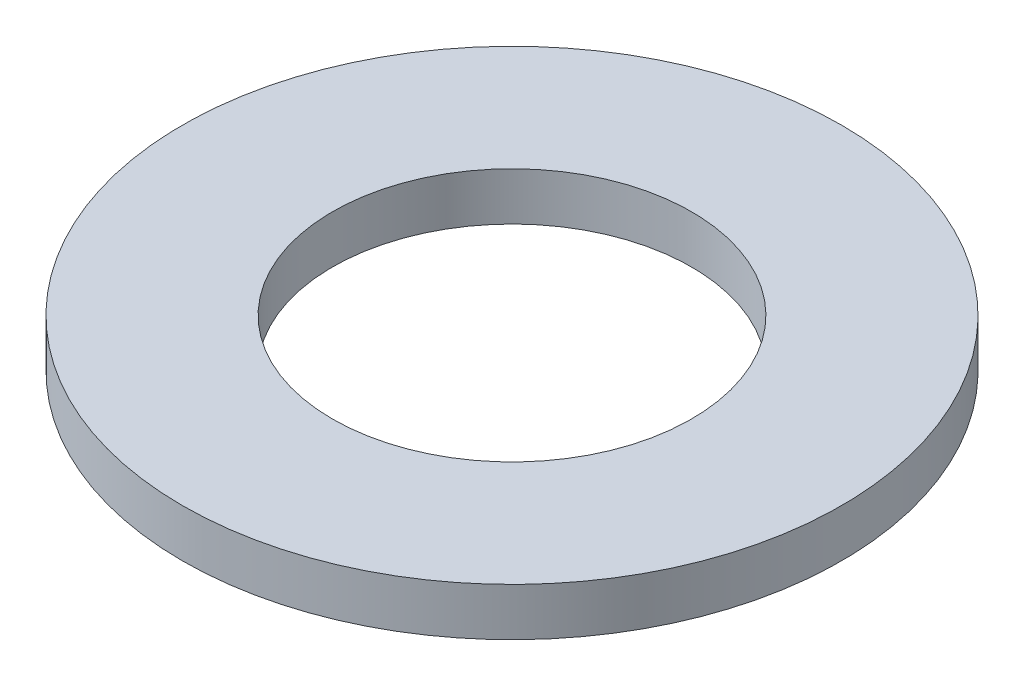
ISO-10303-21;
HEADER;
FILE_DESCRIPTION(('STEP AP214'),'2;1');
FILE_NAME('part.step','',(''),(''),'','','');
FILE_SCHEMA(('AUTOMOTIVE_DESIGN { 1 0 10303 214 1 1 1 1 }'));
ENDSEC;
DATA;
#1=APPLICATION_CONTEXT('core data for automotive mechanical design processes');
#2=APPLICATION_PROTOCOL_DEFINITION('international standard','automotive_design',2000,#1);
#3=PRODUCT_CONTEXT('',#1,'mechanical');
#4=PRODUCT('Part','Part','',(#3));
#5=PRODUCT_RELATED_PRODUCT_CATEGORY('part','',(#4));
#6=PRODUCT_DEFINITION_FORMATION('','',#4);
#7=PRODUCT_DEFINITION_CONTEXT('part definition',#1,'design');
#8=PRODUCT_DEFINITION('design','',#6,#7);
#9=PRODUCT_DEFINITION_SHAPE('','',#8);
#10=(LENGTH_UNIT() NAMED_UNIT(*) SI_UNIT(.MILLI.,.METRE.));
#11=(NAMED_UNIT(*) PLANE_ANGLE_UNIT() SI_UNIT($,.RADIAN.));
#12=(NAMED_UNIT(*) SI_UNIT($,.STERADIAN.) SOLID_ANGLE_UNIT());
#13=UNCERTAINTY_MEASURE_WITH_UNIT(LENGTH_MEASURE(1.E-05),#10,'distance_accuracy_value','');
#14=(GEOMETRIC_REPRESENTATION_CONTEXT(3) GLOBAL_UNCERTAINTY_ASSIGNED_CONTEXT((#13)) GLOBAL_UNIT_ASSIGNED_CONTEXT((#10,
#11,#12)) REPRESENTATION_CONTEXT('',''));
#15=CARTESIAN_POINT('',(0.,0.,0.));
#16=DIRECTION('',(0.,0.,1.));
#17=DIRECTION('',(1.,0.,0.));
#18=AXIS2_PLACEMENT_3D('',#15,#16,#17);
#19=CARTESIAN_POINT('',(0.,0.8636,0.));
#20=DIRECTION('',(0.,-1.,0.));
#21=DIRECTION('',(0.,0.,-1.));
#22=AXIS2_PLACEMENT_3D('',#19,#20,#21);
#23=CYLINDRICAL_SURFACE('',#22,5.9436);
#24=CARTESIAN_POINT('',(0.,0.8636,0.));
#25=DIRECTION('',(0.,1.,0.));
#26=DIRECTION('',(0.,0.,1.));
#27=AXIS2_PLACEMENT_3D('',#24,#25,#26);
#28=CIRCLE('',#27,5.9436);
#29=CARTESIAN_POINT('',(0.,0.8636,5.9436));
#30=VERTEX_POINT('',#29);
#31=EDGE_CURVE('E10',#30,#30,#28,.T.);
#32=ORIENTED_EDGE('',*,*,#31,.F.);
#33=EDGE_LOOP('',(#32));
#34=FACE_BOUND('',#33,.T.);
#35=CARTESIAN_POINT('',(0.,0.,0.));
#36=DIRECTION('',(0.,1.,0.));
#37=DIRECTION('',(0.,0.,1.));
#38=AXIS2_PLACEMENT_3D('',#35,#36,#37);
#39=CIRCLE('',#38,5.9436);
#40=CARTESIAN_POINT('',(0.,0.,5.9436));
#41=VERTEX_POINT('',#40);
#42=EDGE_CURVE('E38',#41,#41,#39,.T.);
#43=ORIENTED_EDGE('',*,*,#42,.T.);
#44=EDGE_LOOP('',(#43));
#45=FACE_BOUND('',#44,.T.);
#46=ADVANCED_FACE('F35',(#34,#45),#23,.T.);
#47=CARTESIAN_POINT('',(0.,0.8636,0.));
#48=DIRECTION('',(0.,1.,0.));
#49=DIRECTION('',(0.,0.,1.));
#50=AXIS2_PLACEMENT_3D('',#47,#48,#49);
#51=PLANE('',#50);
#52=CARTESIAN_POINT('',(0.,0.8636,0.));
#53=DIRECTION('',(0.,1.,0.));
#54=DIRECTION('',(0.,0.,1.));
#55=AXIS2_PLACEMENT_3D('',#52,#53,#54);
#56=CIRCLE('',#55,3.2385);
#57=CARTESIAN_POINT('',(0.,0.8636,3.2385));
#58=VERTEX_POINT('',#57);
#59=EDGE_CURVE('E47',#58,#58,#56,.T.);
#60=ORIENTED_EDGE('',*,*,#59,.F.);
#61=EDGE_LOOP('',(#60));
#62=FACE_BOUND('',#61,.T.);
#63=ORIENTED_EDGE('',*,*,#31,.T.);
#64=EDGE_LOOP('',(#63));
#65=FACE_BOUND('',#64,.T.);
#66=ADVANCED_FACE('F62',(#62,#65),#51,.T.);
#67=CARTESIAN_POINT('',(0.,0.,0.));
#68=DIRECTION('',(0.,1.,0.));
#69=DIRECTION('',(0.,0.,1.));
#70=AXIS2_PLACEMENT_3D('',#67,#68,#69);
#71=PLANE('',#70);
#72=CARTESIAN_POINT('',(0.,0.,0.));
#73=DIRECTION('',(0.,1.,0.));
#74=DIRECTION('',(0.,0.,1.));
#75=AXIS2_PLACEMENT_3D('',#72,#73,#74);
#76=CIRCLE('',#75,3.2385);
#77=CARTESIAN_POINT('',(0.,0.,3.2385));
#78=VERTEX_POINT('',#77);
#79=EDGE_CURVE('E45',#78,#78,#76,.T.);
#80=ORIENTED_EDGE('',*,*,#79,.T.);
#81=EDGE_LOOP('',(#80));
#82=FACE_BOUND('',#81,.T.);
#83=ORIENTED_EDGE('',*,*,#42,.F.);
#84=EDGE_LOOP('',(#83));
#85=FACE_BOUND('',#84,.T.);
#86=ADVANCED_FACE('F53',(#82,#85),#71,.F.);
#87=CARTESIAN_POINT('',(0.,0.,0.));
#88=DIRECTION('',(0.,1.,0.));
#89=DIRECTION('',(0.,0.,1.));
#90=AXIS2_PLACEMENT_3D('',#87,#88,#89);
#91=CYLINDRICAL_SURFACE('',#90,3.2385);
#92=ORIENTED_EDGE('',*,*,#79,.F.);
#93=EDGE_LOOP('',(#92));
#94=FACE_BOUND('',#93,.T.);
#95=ORIENTED_EDGE('',*,*,#59,.T.);
#96=EDGE_LOOP('',(#95));
#97=FACE_BOUND('',#96,.T.);
#98=ADVANCED_FACE('F56',(#94,#97),#91,.F.);
#99=CLOSED_SHELL('',(#46,#66,#86,#98));
#100=MANIFOLD_SOLID_BREP('B2',#99);
#101=ADVANCED_BREP_SHAPE_REPRESENTATION('',(#18,#100),#14);
#102=SHAPE_DEFINITION_REPRESENTATION(#9,#101);
ENDSEC;
END-ISO-10303-21;
